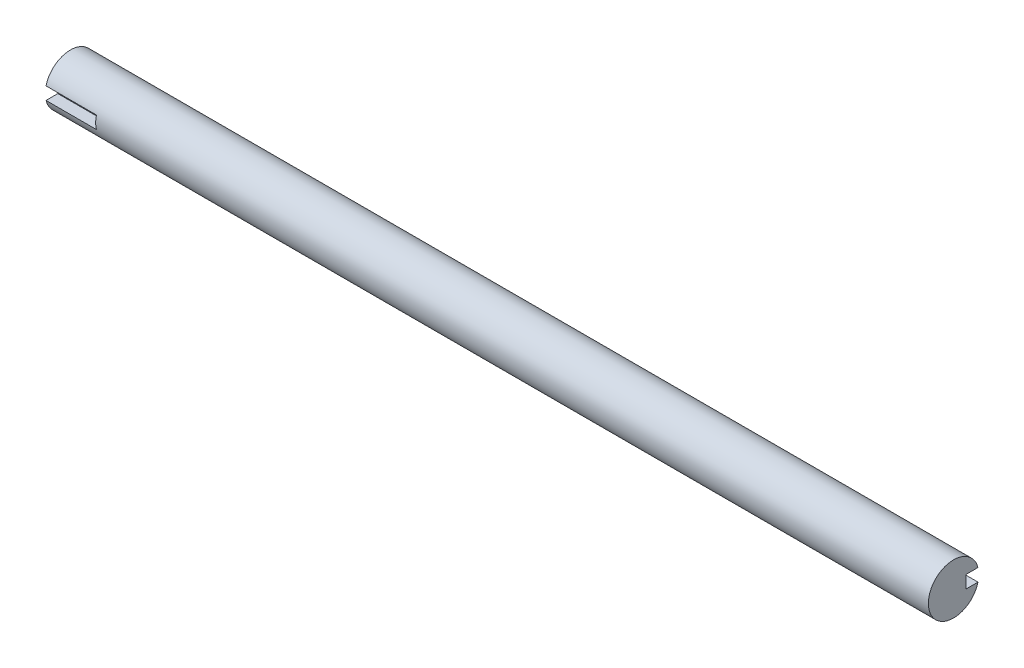
ISO-10303-21;
HEADER;
FILE_DESCRIPTION(('STEP AP214'),'2;1');
FILE_NAME('part.step','',(''),(''),'','','');
FILE_SCHEMA(('AUTOMOTIVE_DESIGN { 1 0 10303 214 1 1 1 1 }'));
ENDSEC;
DATA;
#1=APPLICATION_CONTEXT('core data for automotive mechanical design processes');
#2=APPLICATION_PROTOCOL_DEFINITION('international standard','automotive_design',2000,#1);
#3=PRODUCT_CONTEXT('',#1,'mechanical');
#4=PRODUCT('Part','Part','',(#3));
#5=PRODUCT_RELATED_PRODUCT_CATEGORY('part','',(#4));
#6=PRODUCT_DEFINITION_FORMATION('','',#4);
#7=PRODUCT_DEFINITION_CONTEXT('part definition',#1,'design');
#8=PRODUCT_DEFINITION('design','',#6,#7);
#9=PRODUCT_DEFINITION_SHAPE('','',#8);
#10=(LENGTH_UNIT() NAMED_UNIT(*) SI_UNIT(.MILLI.,.METRE.));
#11=(NAMED_UNIT(*) PLANE_ANGLE_UNIT() SI_UNIT($,.RADIAN.));
#12=(NAMED_UNIT(*) SI_UNIT($,.STERADIAN.) SOLID_ANGLE_UNIT());
#13=UNCERTAINTY_MEASURE_WITH_UNIT(LENGTH_MEASURE(1.E-05),#10,'distance_accuracy_value','');
#14=(GEOMETRIC_REPRESENTATION_CONTEXT(3) GLOBAL_UNCERTAINTY_ASSIGNED_CONTEXT((#13)) GLOBAL_UNIT_ASSIGNED_CONTEXT((#10,
#11,#12)) REPRESENTATION_CONTEXT('',''));
#15=CARTESIAN_POINT('',(0.,0.,0.));
#16=DIRECTION('',(0.,0.,1.));
#17=DIRECTION('',(1.,0.,0.));
#18=AXIS2_PLACEMENT_3D('',#15,#16,#17);
#19=CARTESIAN_POINT('',(350.,0.,0.));
#20=DIRECTION('',(-1.,0.,0.));
#21=DIRECTION('',(0.,0.,1.));
#22=AXIS2_PLACEMENT_3D('',#19,#20,#21);
#23=CYLINDRICAL_SURFACE('',#22,10.);
#24=CARTESIAN_POINT('',(20.,0.,0.));
#25=DIRECTION('',(-1.,0.,0.));
#26=DIRECTION('',(0.,0.,1.));
#27=AXIS2_PLACEMENT_3D('',#24,#25,#26);
#28=CIRCLE('',#27,10.);
#29=CARTESIAN_POINT('',(20.,-2.5,9.68245836551854));
#30=VERTEX_POINT('',#29);
#31=CARTESIAN_POINT('',(20.,2.5,9.68245836551854));
#32=VERTEX_POINT('',#31);
#33=EDGE_CURVE('E40',#30,#32,#28,.T.);
#34=ORIENTED_EDGE('',*,*,#33,.F.);
#35=DIRECTION('',(-1.,0.,0.));
#36=VECTOR('',#35,1.);
#37=CARTESIAN_POINT('',(350.,-2.5,9.68245836551854));
#38=LINE('',#37,#36);
#39=CARTESIAN_POINT('',(0.,-2.5,9.68245836551854));
#40=VERTEX_POINT('',#39);
#41=EDGE_CURVE('E151',#30,#40,#38,.T.);
#42=ORIENTED_EDGE('',*,*,#41,.T.);
#43=CARTESIAN_POINT('',(0.,0.,0.));
#44=DIRECTION('',(1.,0.,0.));
#45=DIRECTION('',(0.,0.,-1.));
#46=AXIS2_PLACEMENT_3D('',#43,#44,#45);
#47=CIRCLE('',#46,10.);
#48=CARTESIAN_POINT('',(0.,2.5,9.68245836551854));
#49=VERTEX_POINT('',#48);
#50=EDGE_CURVE('E154',#40,#49,#47,.T.);
#51=ORIENTED_EDGE('',*,*,#50,.T.);
#52=DIRECTION('',(-1.,0.,0.));
#53=VECTOR('',#52,1.);
#54=CARTESIAN_POINT('',(350.,2.5,9.68245836551854));
#55=LINE('',#54,#53);
#56=EDGE_CURVE('E55',#32,#49,#55,.T.);
#57=ORIENTED_EDGE('',*,*,#56,.F.);
#58=EDGE_LOOP('',(#34,#42,#51,#57));
#59=FACE_BOUND('',#58,.T.);
#60=DIRECTION('',(-1.,0.,0.));
#61=VECTOR('',#60,1.);
#62=CARTESIAN_POINT('',(350.,2.5,-9.68245836551854));
#63=LINE('',#62,#61);
#64=CARTESIAN_POINT('',(330.,2.5,-9.68245836551854));
#65=VERTEX_POINT('',#64);
#66=CARTESIAN_POINT('',(350.,2.5,-9.68245836551854));
#67=VERTEX_POINT('',#66);
#68=EDGE_CURVE('E130',#65,#67,#63,.F.);
#69=ORIENTED_EDGE('',*,*,#68,.F.);
#70=CARTESIAN_POINT('',(330.,0.,0.));
#71=DIRECTION('',(-1.,0.,0.));
#72=DIRECTION('',(0.,0.,1.));
#73=AXIS2_PLACEMENT_3D('',#70,#71,#72);
#74=CIRCLE('',#73,10.);
#75=CARTESIAN_POINT('',(330.,-2.5,-9.68245836551854));
#76=VERTEX_POINT('',#75);
#77=EDGE_CURVE('E11',#65,#76,#74,.T.);
#78=ORIENTED_EDGE('',*,*,#77,.T.);
#79=DIRECTION('',(-1.,0.,0.));
#80=VECTOR('',#79,1.);
#81=CARTESIAN_POINT('',(350.,-2.5,-9.68245836551854));
#82=LINE('',#81,#80);
#83=CARTESIAN_POINT('',(350.,-2.5,-9.68245836551854));
#84=VERTEX_POINT('',#83);
#85=EDGE_CURVE('E108',#76,#84,#82,.F.);
#86=ORIENTED_EDGE('',*,*,#85,.T.);
#87=CARTESIAN_POINT('',(350.,0.,0.));
#88=DIRECTION('',(1.,0.,0.));
#89=DIRECTION('',(0.,0.,-1.));
#90=AXIS2_PLACEMENT_3D('',#87,#88,#89);
#91=CIRCLE('',#90,10.);
#92=EDGE_CURVE('E155',#67,#84,#91,.T.);
#93=ORIENTED_EDGE('',*,*,#92,.F.);
#94=EDGE_LOOP('',(#69,#78,#86,#93));
#95=FACE_BOUND('',#94,.T.);
#96=ADVANCED_FACE('F33',(#59,#95),#23,.T.);
#97=CARTESIAN_POINT('',(350.,0.,0.));
#98=DIRECTION('',(1.,0.,0.));
#99=DIRECTION('',(0.,0.,-1.));
#100=AXIS2_PLACEMENT_3D('',#97,#98,#99);
#101=PLANE('',#100);
#102=DIRECTION('',(0.,-1.,0.));
#103=VECTOR('',#102,1.);
#104=CARTESIAN_POINT('',(350.,2.5,-5.));
#105=LINE('',#104,#103);
#106=CARTESIAN_POINT('',(350.,2.5,-5.));
#107=VERTEX_POINT('',#106);
#108=CARTESIAN_POINT('',(350.,-2.5,-5.));
#109=VERTEX_POINT('',#108);
#110=EDGE_CURVE('E105',#107,#109,#105,.T.);
#111=ORIENTED_EDGE('',*,*,#110,.F.);
#112=DIRECTION('',(0.,0.,-1.));
#113=VECTOR('',#112,1.);
#114=CARTESIAN_POINT('',(350.,2.5,-5.));
#115=LINE('',#114,#113);
#116=EDGE_CURVE('E47',#107,#67,#115,.T.);
#117=ORIENTED_EDGE('',*,*,#116,.T.);
#118=ORIENTED_EDGE('',*,*,#92,.T.);
#119=DIRECTION('',(0.,0.,-1.));
#120=VECTOR('',#119,1.);
#121=CARTESIAN_POINT('',(350.,-2.5,-5.));
#122=LINE('',#121,#120);
#123=EDGE_CURVE('E126',#109,#84,#122,.T.);
#124=ORIENTED_EDGE('',*,*,#123,.F.);
#125=EDGE_LOOP('',(#111,#117,#118,#124));
#126=FACE_BOUND('',#125,.T.);
#127=ADVANCED_FACE('F188',(#126),#101,.T.);
#128=CARTESIAN_POINT('',(0.,0.,0.));
#129=DIRECTION('',(1.,0.,0.));
#130=DIRECTION('',(0.,0.,-1.));
#131=AXIS2_PLACEMENT_3D('',#128,#129,#130);
#132=PLANE('',#131);
#133=ORIENTED_EDGE('',*,*,#50,.F.);
#134=DIRECTION('',(0.,0.,1.));
#135=VECTOR('',#134,1.);
#136=CARTESIAN_POINT('',(0.,-2.5,5.));
#137=LINE('',#136,#135);
#138=CARTESIAN_POINT('',(0.,-2.5,5.));
#139=VERTEX_POINT('',#138);
#140=EDGE_CURVE('E132',#139,#40,#137,.T.);
#141=ORIENTED_EDGE('',*,*,#140,.F.);
#142=DIRECTION('',(0.,1.,0.));
#143=VECTOR('',#142,1.);
#144=CARTESIAN_POINT('',(0.,-2.5,5.));
#145=LINE('',#144,#143);
#146=CARTESIAN_POINT('',(0.,2.5,5.));
#147=VERTEX_POINT('',#146);
#148=EDGE_CURVE('E137',#139,#147,#145,.T.);
#149=ORIENTED_EDGE('',*,*,#148,.T.);
#150=DIRECTION('',(0.,0.,1.));
#151=VECTOR('',#150,1.);
#152=CARTESIAN_POINT('',(0.,2.5,5.));
#153=LINE('',#152,#151);
#154=EDGE_CURVE('E143',#147,#49,#153,.T.);
#155=ORIENTED_EDGE('',*,*,#154,.T.);
#156=EDGE_LOOP('',(#133,#141,#149,#155));
#157=FACE_BOUND('',#156,.T.);
#158=ADVANCED_FACE('F172',(#157),#132,.F.);
#159=CARTESIAN_POINT('',(20.,0.,0.));
#160=DIRECTION('',(-1.,0.,0.));
#161=DIRECTION('',(0.,0.,1.));
#162=AXIS2_PLACEMENT_3D('',#159,#160,#161);
#163=PLANE('',#162);
#164=ORIENTED_EDGE('',*,*,#33,.T.);
#165=DIRECTION('',(0.,0.,1.));
#166=VECTOR('',#165,1.);
#167=CARTESIAN_POINT('',(20.,2.5,5.));
#168=LINE('',#167,#166);
#169=CARTESIAN_POINT('',(20.,2.5,5.));
#170=VERTEX_POINT('',#169);
#171=EDGE_CURVE('E136',#170,#32,#168,.T.);
#172=ORIENTED_EDGE('',*,*,#171,.F.);
#173=DIRECTION('',(0.,1.,0.));
#174=VECTOR('',#173,1.);
#175=CARTESIAN_POINT('',(20.,-2.5,5.));
#176=LINE('',#175,#174);
#177=CARTESIAN_POINT('',(20.,-2.5,5.));
#178=VERTEX_POINT('',#177);
#179=EDGE_CURVE('E139',#178,#170,#176,.T.);
#180=ORIENTED_EDGE('',*,*,#179,.F.);
#181=DIRECTION('',(0.,0.,1.));
#182=VECTOR('',#181,1.);
#183=CARTESIAN_POINT('',(20.,-2.5,5.));
#184=LINE('',#183,#182);
#185=EDGE_CURVE('E133',#178,#30,#184,.T.);
#186=ORIENTED_EDGE('',*,*,#185,.T.);
#187=EDGE_LOOP('',(#164,#172,#180,#186));
#188=FACE_BOUND('',#187,.T.);
#189=ADVANCED_FACE('F162',(#188),#163,.T.);
#190=CARTESIAN_POINT('',(20.,-2.5,5.));
#191=DIRECTION('',(0.,-1.,0.));
#192=DIRECTION('',(0.,0.,-1.));
#193=AXIS2_PLACEMENT_3D('',#190,#191,#192);
#194=PLANE('',#193);
#195=ORIENTED_EDGE('',*,*,#185,.F.);
#196=DIRECTION('',(-1.,0.,0.));
#197=VECTOR('',#196,1.);
#198=CARTESIAN_POINT('',(20.,-2.5,5.));
#199=LINE('',#198,#197);
#200=EDGE_CURVE('E147',#178,#139,#199,.T.);
#201=ORIENTED_EDGE('',*,*,#200,.T.);
#202=ORIENTED_EDGE('',*,*,#140,.T.);
#203=ORIENTED_EDGE('',*,*,#41,.F.);
#204=EDGE_LOOP('',(#195,#201,#202,#203));
#205=FACE_BOUND('',#204,.T.);
#206=ADVANCED_FACE('F177',(#205),#194,.F.);
#207=CARTESIAN_POINT('',(20.,2.5,5.));
#208=DIRECTION('',(0.,-1.,0.));
#209=DIRECTION('',(0.,0.,-1.));
#210=AXIS2_PLACEMENT_3D('',#207,#208,#209);
#211=PLANE('',#210);
#212=ORIENTED_EDGE('',*,*,#56,.T.);
#213=ORIENTED_EDGE('',*,*,#154,.F.);
#214=DIRECTION('',(-1.,0.,0.));
#215=VECTOR('',#214,1.);
#216=CARTESIAN_POINT('',(20.,2.5,5.));
#217=LINE('',#216,#215);
#218=EDGE_CURVE('E141',#170,#147,#217,.T.);
#219=ORIENTED_EDGE('',*,*,#218,.F.);
#220=ORIENTED_EDGE('',*,*,#171,.T.);
#221=EDGE_LOOP('',(#212,#213,#219,#220));
#222=FACE_BOUND('',#221,.T.);
#223=ADVANCED_FACE('F167',(#222),#211,.T.);
#224=CARTESIAN_POINT('',(20.,-2.5,5.));
#225=DIRECTION('',(0.,0.,1.));
#226=DIRECTION('',(1.,0.,0.));
#227=AXIS2_PLACEMENT_3D('',#224,#225,#226);
#228=PLANE('',#227);
#229=ORIENTED_EDGE('',*,*,#148,.F.);
#230=ORIENTED_EDGE('',*,*,#200,.F.);
#231=ORIENTED_EDGE('',*,*,#179,.T.);
#232=ORIENTED_EDGE('',*,*,#218,.T.);
#233=EDGE_LOOP('',(#229,#230,#231,#232));
#234=FACE_BOUND('',#233,.T.);
#235=ADVANCED_FACE('F175',(#234),#228,.T.);
#236=CARTESIAN_POINT('',(330.,0.,0.));
#237=DIRECTION('',(-1.,0.,0.));
#238=DIRECTION('',(0.,0.,1.));
#239=AXIS2_PLACEMENT_3D('',#236,#237,#238);
#240=PLANE('',#239);
#241=DIRECTION('',(0.,0.,-1.));
#242=VECTOR('',#241,1.);
#243=CARTESIAN_POINT('',(330.,2.5,-5.));
#244=LINE('',#243,#242);
#245=CARTESIAN_POINT('',(330.,2.5,-5.));
#246=VERTEX_POINT('',#245);
#247=EDGE_CURVE('E116',#246,#65,#244,.T.);
#248=ORIENTED_EDGE('',*,*,#247,.F.);
#249=DIRECTION('',(0.,-1.,0.));
#250=VECTOR('',#249,1.);
#251=CARTESIAN_POINT('',(330.,2.5,-5.));
#252=LINE('',#251,#250);
#253=CARTESIAN_POINT('',(330.,-2.5,-5.));
#254=VERTEX_POINT('',#253);
#255=EDGE_CURVE('E103',#246,#254,#252,.T.);
#256=ORIENTED_EDGE('',*,*,#255,.T.);
#257=DIRECTION('',(0.,0.,-1.));
#258=VECTOR('',#257,1.);
#259=CARTESIAN_POINT('',(330.,-2.5,-5.));
#260=LINE('',#259,#258);
#261=EDGE_CURVE('E112',#254,#76,#260,.T.);
#262=ORIENTED_EDGE('',*,*,#261,.T.);
#263=ORIENTED_EDGE('',*,*,#77,.F.);
#264=EDGE_LOOP('',(#248,#256,#262,#263));
#265=FACE_BOUND('',#264,.T.);
#266=ADVANCED_FACE('F119',(#265),#240,.F.);
#267=CARTESIAN_POINT('',(330.,2.5,-5.));
#268=DIRECTION('',(0.,-1.,0.));
#269=DIRECTION('',(0.,0.,-1.));
#270=AXIS2_PLACEMENT_3D('',#267,#268,#269);
#271=PLANE('',#270);
#272=ORIENTED_EDGE('',*,*,#68,.T.);
#273=ORIENTED_EDGE('',*,*,#116,.F.);
#274=DIRECTION('',(1.,0.,0.));
#275=VECTOR('',#274,1.);
#276=CARTESIAN_POINT('',(330.,2.5,-5.));
#277=LINE('',#276,#275);
#278=EDGE_CURVE('E109',#246,#107,#277,.T.);
#279=ORIENTED_EDGE('',*,*,#278,.F.);
#280=ORIENTED_EDGE('',*,*,#247,.T.);
#281=EDGE_LOOP('',(#272,#273,#279,#280));
#282=FACE_BOUND('',#281,.T.);
#283=ADVANCED_FACE('F200',(#282),#271,.T.);
#284=CARTESIAN_POINT('',(330.,-2.5,-5.));
#285=DIRECTION('',(0.,-1.,0.));
#286=DIRECTION('',(0.,0.,-1.));
#287=AXIS2_PLACEMENT_3D('',#284,#285,#286);
#288=PLANE('',#287);
#289=ORIENTED_EDGE('',*,*,#261,.F.);
#290=DIRECTION('',(1.,0.,0.));
#291=VECTOR('',#290,1.);
#292=CARTESIAN_POINT('',(330.,-2.5,-5.));
#293=LINE('',#292,#291);
#294=EDGE_CURVE('E99',#254,#109,#293,.T.);
#295=ORIENTED_EDGE('',*,*,#294,.T.);
#296=ORIENTED_EDGE('',*,*,#123,.T.);
#297=ORIENTED_EDGE('',*,*,#85,.F.);
#298=EDGE_LOOP('',(#289,#295,#296,#297));
#299=FACE_BOUND('',#298,.T.);
#300=ADVANCED_FACE('F113',(#299),#288,.F.);
#301=CARTESIAN_POINT('',(330.,2.5,-5.));
#302=DIRECTION('',(0.,0.,1.));
#303=DIRECTION('',(0.,-1.,0.));
#304=AXIS2_PLACEMENT_3D('',#301,#302,#303);
#305=PLANE('',#304);
#306=ORIENTED_EDGE('',*,*,#110,.T.);
#307=ORIENTED_EDGE('',*,*,#294,.F.);
#308=ORIENTED_EDGE('',*,*,#255,.F.);
#309=ORIENTED_EDGE('',*,*,#278,.T.);
#310=EDGE_LOOP('',(#306,#307,#308,#309));
#311=FACE_BOUND('',#310,.T.);
#312=ADVANCED_FACE('F101',(#311),#305,.F.);
#313=CLOSED_SHELL('',(#96,#127,#158,#189,#206,#223,#235,#266,#283,#300,#312));
#314=MANIFOLD_SOLID_BREP('B2',#313);
#315=ADVANCED_BREP_SHAPE_REPRESENTATION('',(#18,#314),#14);
#316=SHAPE_DEFINITION_REPRESENTATION(#9,#315);
ENDSEC;
END-ISO-10303-21;
